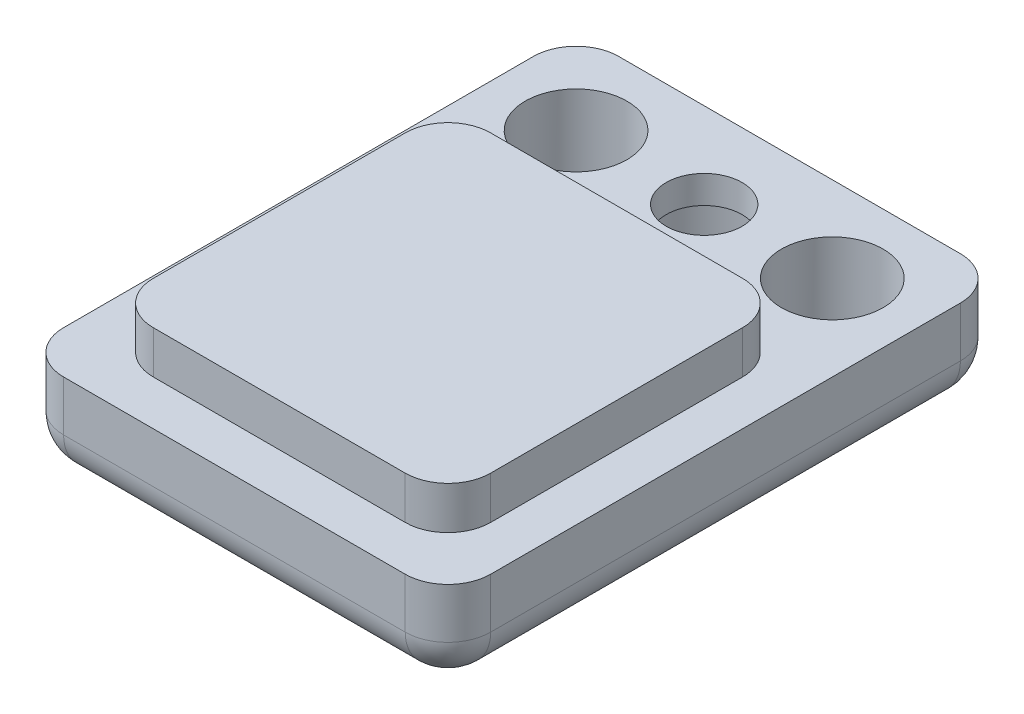
ISO-10303-21;
HEADER;
FILE_DESCRIPTION(('STEP AP214'),'2;1');
FILE_NAME('part.step','',(''),(''),'','','');
FILE_SCHEMA(('AUTOMOTIVE_DESIGN { 1 0 10303 214 1 1 1 1 }'));
ENDSEC;
DATA;
#1=APPLICATION_CONTEXT('core data for automotive mechanical design processes');
#2=APPLICATION_PROTOCOL_DEFINITION('international standard','automotive_design',2000,#1);
#3=PRODUCT_CONTEXT('',#1,'mechanical');
#4=PRODUCT('Part','Part','',(#3));
#5=PRODUCT_RELATED_PRODUCT_CATEGORY('part','',(#4));
#6=PRODUCT_DEFINITION_FORMATION('','',#4);
#7=PRODUCT_DEFINITION_CONTEXT('part definition',#1,'design');
#8=PRODUCT_DEFINITION('design','',#6,#7);
#9=PRODUCT_DEFINITION_SHAPE('','',#8);
#10=(LENGTH_UNIT() NAMED_UNIT(*) SI_UNIT(.MILLI.,.METRE.));
#11=(NAMED_UNIT(*) PLANE_ANGLE_UNIT() SI_UNIT($,.RADIAN.));
#12=(NAMED_UNIT(*) SI_UNIT($,.STERADIAN.) SOLID_ANGLE_UNIT());
#13=UNCERTAINTY_MEASURE_WITH_UNIT(LENGTH_MEASURE(1.E-05),#10,'distance_accuracy_value','');
#14=(GEOMETRIC_REPRESENTATION_CONTEXT(3) GLOBAL_UNCERTAINTY_ASSIGNED_CONTEXT((#13)) GLOBAL_UNIT_ASSIGNED_CONTEXT((#10,
#11,#12)) REPRESENTATION_CONTEXT('',''));
#15=CARTESIAN_POINT('',(0.,0.,0.));
#16=DIRECTION('',(0.,0.,1.));
#17=DIRECTION('',(1.,0.,0.));
#18=AXIS2_PLACEMENT_3D('',#15,#16,#17);
#19=CARTESIAN_POINT('',(-5.,0.,-6.5));
#20=DIRECTION('',(0.,1.,0.));
#21=DIRECTION('',(0.,0.,1.));
#22=AXIS2_PLACEMENT_3D('',#19,#20,#21);
#23=PLANE('',#22);
#24=CARTESIAN_POINT('',(-3.,0.,-4.5));
#25=DIRECTION('',(0.,-1.,0.));
#26=DIRECTION('',(0.,0.,-1.));
#27=AXIS2_PLACEMENT_3D('',#24,#25,#26);
#28=CIRCLE('',#27,1.190625);
#29=CARTESIAN_POINT('',(-2.35378959260548,0.,-5.5));
#30=VERTEX_POINT('',#29);
#31=CARTESIAN_POINT('',(-4.,0.,-3.85378959260548));
#32=VERTEX_POINT('',#31);
#33=EDGE_CURVE('E312',#30,#32,#28,.T.);
#34=ORIENTED_EDGE('',*,*,#33,.F.);
#35=DIRECTION('',(-1.,0.,0.));
#36=VECTOR('',#35,1.);
#37=CARTESIAN_POINT('',(-5.,0.,-5.5));
#38=LINE('',#37,#36);
#39=CARTESIAN_POINT('',(-1.23294616670802,0.,-5.5));
#40=VERTEX_POINT('',#39);
#41=EDGE_CURVE('E239',#30,#40,#38,.F.);
#42=ORIENTED_EDGE('',*,*,#41,.T.);
#43=CARTESIAN_POINT('',(0.,0.,-4.5));
#44=DIRECTION('',(0.,-1.,0.));
#45=DIRECTION('',(0.,0.,-1.));
#46=AXIS2_PLACEMENT_3D('',#43,#44,#45);
#47=CIRCLE('',#46,1.5875);
#48=CARTESIAN_POINT('',(1.23294616670802,0.,-5.5));
#49=VERTEX_POINT('',#48);
#50=EDGE_CURVE('E329',#49,#40,#47,.T.);
#51=ORIENTED_EDGE('',*,*,#50,.F.);
#52=DIRECTION('',(-1.,0.,0.));
#53=VECTOR('',#52,1.);
#54=CARTESIAN_POINT('',(-5.,0.,-5.5));
#55=LINE('',#54,#53);
#56=CARTESIAN_POINT('',(2.35378959260548,0.,-5.5));
#57=VERTEX_POINT('',#56);
#58=EDGE_CURVE('E237',#49,#57,#55,.F.);
#59=ORIENTED_EDGE('',*,*,#58,.T.);
#60=CARTESIAN_POINT('',(3.,0.,-4.5));
#61=DIRECTION('',(0.,-1.,0.));
#62=DIRECTION('',(0.,0.,-1.));
#63=AXIS2_PLACEMENT_3D('',#60,#61,#62);
#64=CIRCLE('',#63,1.190625);
#65=CARTESIAN_POINT('',(4.,0.,-3.85378959260548));
#66=VERTEX_POINT('',#65);
#67=EDGE_CURVE('E327',#66,#57,#64,.T.);
#68=ORIENTED_EDGE('',*,*,#67,.F.);
#69=DIRECTION('',(0.,0.,-1.));
#70=VECTOR('',#69,1.);
#71=CARTESIAN_POINT('',(4.,0.,-6.5));
#72=LINE('',#71,#70);
#73=CARTESIAN_POINT('',(4.,0.,5.5));
#74=VERTEX_POINT('',#73);
#75=EDGE_CURVE('E226',#66,#74,#72,.F.);
#76=ORIENTED_EDGE('',*,*,#75,.T.);
#77=DIRECTION('',(1.,0.,0.));
#78=VECTOR('',#77,1.);
#79=CARTESIAN_POINT('',(-5.,0.,5.5));
#80=LINE('',#79,#78);
#81=CARTESIAN_POINT('',(-4.,0.,5.5));
#82=VERTEX_POINT('',#81);
#83=EDGE_CURVE('E217',#74,#82,#80,.F.);
#84=ORIENTED_EDGE('',*,*,#83,.T.);
#85=DIRECTION('',(0.,0.,1.));
#86=VECTOR('',#85,1.);
#87=CARTESIAN_POINT('',(-4.,0.,-6.5));
#88=LINE('',#87,#86);
#89=EDGE_CURVE('E220',#82,#32,#88,.F.);
#90=ORIENTED_EDGE('',*,*,#89,.T.);
#91=EDGE_LOOP('',(#34,#42,#51,#59,#68,#76,#84,#90));
#92=FACE_BOUND('',#91,.T.);
#93=ADVANCED_FACE('F31',(#92),#23,.F.);
#94=CARTESIAN_POINT('',(3.64621040739452,0.,-5.5));
#95=VERTEX_POINT('',#94);
#96=CARTESIAN_POINT('',(4.,0.,-5.14621040739452));
#97=VERTEX_POINT('',#96);
#98=EDGE_CURVE('E334',#95,#97,#64,.T.);
#99=ORIENTED_EDGE('',*,*,#98,.F.);
#100=DIRECTION('',(-1.,0.,0.));
#101=VECTOR('',#100,1.);
#102=CARTESIAN_POINT('',(-5.,0.,-5.5));
#103=LINE('',#102,#101);
#104=CARTESIAN_POINT('',(4.,0.,-5.5));
#105=VERTEX_POINT('',#104);
#106=EDGE_CURVE('E235',#95,#105,#103,.F.);
#107=ORIENTED_EDGE('',*,*,#106,.T.);
#108=DIRECTION('',(0.,0.,-1.));
#109=VECTOR('',#108,1.);
#110=CARTESIAN_POINT('',(4.,0.,-6.5));
#111=LINE('',#110,#109);
#112=EDGE_CURVE('E233',#105,#97,#111,.F.);
#113=ORIENTED_EDGE('',*,*,#112,.T.);
#114=EDGE_LOOP('',(#99,#107,#113));
#115=FACE_BOUND('',#114,.T.);
#116=ADVANCED_FACE('F384',(#115),#23,.F.);
#117=CARTESIAN_POINT('',(-5.,2.175,-6.5));
#118=DIRECTION('',(0.,1.,0.));
#119=DIRECTION('',(0.,0.,1.));
#120=AXIS2_PLACEMENT_3D('',#117,#118,#119);
#121=PLANE('',#120);
#122=CARTESIAN_POINT('',(-3.,2.175,-4.5));
#123=DIRECTION('',(0.,1.,0.));
#124=DIRECTION('',(0.,0.,1.));
#125=AXIS2_PLACEMENT_3D('',#122,#123,#124);
#126=CIRCLE('',#125,1.190625);
#127=CARTESIAN_POINT('',(-3.,2.175,-3.309375));
#128=VERTEX_POINT('',#127);
#129=EDGE_CURVE('E320',#128,#128,#126,.T.);
#130=ORIENTED_EDGE('',*,*,#129,.F.);
#131=EDGE_LOOP('',(#130));
#132=FACE_BOUND('',#131,.T.);
#133=CARTESIAN_POINT('',(3.,2.175,-4.5));
#134=DIRECTION('',(0.,1.,0.));
#135=DIRECTION('',(0.,0.,1.));
#136=AXIS2_PLACEMENT_3D('',#133,#134,#135);
#137=CIRCLE('',#136,1.190625);
#138=CARTESIAN_POINT('',(3.,2.175,-3.309375));
#139=VERTEX_POINT('',#138);
#140=EDGE_CURVE('E336',#139,#139,#137,.T.);
#141=ORIENTED_EDGE('',*,*,#140,.F.);
#142=EDGE_LOOP('',(#141));
#143=FACE_BOUND('',#142,.T.);
#144=CARTESIAN_POINT('',(0.,2.175,-4.5));
#145=DIRECTION('',(0.,1.,0.));
#146=DIRECTION('',(0.,0.,1.));
#147=AXIS2_PLACEMENT_3D('',#144,#145,#146);
#148=CIRCLE('',#147,0.888999999999999);
#149=CARTESIAN_POINT('',(0.,2.175,-3.611));
#150=VERTEX_POINT('',#149);
#151=EDGE_CURVE('E349',#150,#150,#148,.T.);
#152=ORIENTED_EDGE('',*,*,#151,.F.);
#153=EDGE_LOOP('',(#152));
#154=FACE_BOUND('',#153,.T.);
#155=DIRECTION('',(1.,0.,0.));
#156=VECTOR('',#155,1.);
#157=CARTESIAN_POINT('',(5.,2.175,6.5));
#158=LINE('',#157,#156);
#159=CARTESIAN_POINT('',(-4.,2.175,6.5));
#160=VERTEX_POINT('',#159);
#161=CARTESIAN_POINT('',(4.,2.175,6.5));
#162=VERTEX_POINT('',#161);
#163=EDGE_CURVE('E374',#160,#162,#158,.T.);
#164=ORIENTED_EDGE('',*,*,#163,.T.);
#165=CARTESIAN_POINT('',(4.,2.175,5.5));
#166=DIRECTION('',(0.,1.,0.));
#167=DIRECTION('',(0.,0.,1.));
#168=AXIS2_PLACEMENT_3D('',#165,#166,#167);
#169=CIRCLE('',#168,1.);
#170=CARTESIAN_POINT('',(5.,2.175,5.5));
#171=VERTEX_POINT('',#170);
#172=EDGE_CURVE('E202',#162,#171,#169,.T.);
#173=ORIENTED_EDGE('',*,*,#172,.T.);
#174=DIRECTION('',(0.,0.,-1.));
#175=VECTOR('',#174,1.);
#176=CARTESIAN_POINT('',(5.,2.175,6.5));
#177=LINE('',#176,#175);
#178=CARTESIAN_POINT('',(5.,2.175,-5.5));
#179=VERTEX_POINT('',#178);
#180=EDGE_CURVE('E198',#171,#179,#177,.T.);
#181=ORIENTED_EDGE('',*,*,#180,.T.);
#182=CARTESIAN_POINT('',(4.,2.175,-5.5));
#183=DIRECTION('',(0.,1.,0.));
#184=DIRECTION('',(0.,0.,1.));
#185=AXIS2_PLACEMENT_3D('',#182,#183,#184);
#186=CIRCLE('',#185,1.);
#187=CARTESIAN_POINT('',(4.,2.175,-6.5));
#188=VERTEX_POINT('',#187);
#189=EDGE_CURVE('E190',#179,#188,#186,.T.);
#190=ORIENTED_EDGE('',*,*,#189,.T.);
#191=DIRECTION('',(-1.,0.,0.));
#192=VECTOR('',#191,1.);
#193=CARTESIAN_POINT('',(5.,2.175,-6.5));
#194=LINE('',#193,#192);
#195=CARTESIAN_POINT('',(-4.,2.175,-6.5));
#196=VERTEX_POINT('',#195);
#197=EDGE_CURVE('E195',#188,#196,#194,.T.);
#198=ORIENTED_EDGE('',*,*,#197,.T.);
#199=CARTESIAN_POINT('',(-4.,2.175,-5.5));
#200=DIRECTION('',(0.,1.,0.));
#201=DIRECTION('',(0.,0.,1.));
#202=AXIS2_PLACEMENT_3D('',#199,#200,#201);
#203=CIRCLE('',#202,1.);
#204=CARTESIAN_POINT('',(-5.,2.175,-5.5));
#205=VERTEX_POINT('',#204);
#206=EDGE_CURVE('E203',#196,#205,#203,.T.);
#207=ORIENTED_EDGE('',*,*,#206,.T.);
#208=DIRECTION('',(0.,0.,1.));
#209=VECTOR('',#208,1.);
#210=CARTESIAN_POINT('',(-5.,2.175,6.5));
#211=LINE('',#210,#209);
#212=CARTESIAN_POINT('',(-5.,2.175,5.5));
#213=VERTEX_POINT('',#212);
#214=EDGE_CURVE('E361',#205,#213,#211,.T.);
#215=ORIENTED_EDGE('',*,*,#214,.T.);
#216=CARTESIAN_POINT('',(-4.,2.175,5.5));
#217=DIRECTION('',(0.,1.,0.));
#218=DIRECTION('',(0.,0.,1.));
#219=AXIS2_PLACEMENT_3D('',#216,#217,#218);
#220=CIRCLE('',#219,1.);
#221=EDGE_CURVE('E482',#213,#160,#220,.T.);
#222=ORIENTED_EDGE('',*,*,#221,.T.);
#223=EDGE_LOOP('',(#164,#173,#181,#190,#198,#207,#215,#222));
#224=FACE_BOUND('',#223,.T.);
#225=DIRECTION('',(1.,0.,0.));
#226=VECTOR('',#225,1.);
#227=CARTESIAN_POINT('',(-3.95,2.175,5.45));
#228=LINE('',#227,#226);
#229=CARTESIAN_POINT('',(-2.95,2.175,5.45));
#230=VERTEX_POINT('',#229);
#231=CARTESIAN_POINT('',(2.95,2.175,5.45));
#232=VERTEX_POINT('',#231);
#233=EDGE_CURVE('E365',#230,#232,#228,.T.);
#234=ORIENTED_EDGE('',*,*,#233,.F.);
#235=CARTESIAN_POINT('',(-2.95,2.175,4.45));
#236=DIRECTION('',(0.,1.,0.));
#237=DIRECTION('',(0.,0.,1.));
#238=AXIS2_PLACEMENT_3D('',#235,#236,#237);
#239=CIRCLE('',#238,1.);
#240=CARTESIAN_POINT('',(-3.95,2.175,4.45));
#241=VERTEX_POINT('',#240);
#242=EDGE_CURVE('E11',#230,#241,#239,.F.);
#243=ORIENTED_EDGE('',*,*,#242,.T.);
#244=DIRECTION('',(0.,0.,1.));
#245=VECTOR('',#244,1.);
#246=CARTESIAN_POINT('',(-3.95,2.175,5.45));
#247=LINE('',#246,#245);
#248=CARTESIAN_POINT('',(-3.95,2.175,-1.45));
#249=VERTEX_POINT('',#248);
#250=EDGE_CURVE('E362',#249,#241,#247,.T.);
#251=ORIENTED_EDGE('',*,*,#250,.F.);
#252=CARTESIAN_POINT('',(-2.95,2.175,-1.45));
#253=DIRECTION('',(0.,1.,0.));
#254=DIRECTION('',(0.,0.,1.));
#255=AXIS2_PLACEMENT_3D('',#252,#253,#254);
#256=CIRCLE('',#255,1.);
#257=CARTESIAN_POINT('',(-2.95,2.175,-2.45));
#258=VERTEX_POINT('',#257);
#259=EDGE_CURVE('E40',#249,#258,#256,.F.);
#260=ORIENTED_EDGE('',*,*,#259,.T.);
#261=DIRECTION('',(-1.,0.,0.));
#262=VECTOR('',#261,1.);
#263=CARTESIAN_POINT('',(-3.95,2.175,-2.45));
#264=LINE('',#263,#262);
#265=CARTESIAN_POINT('',(2.95,2.175,-2.45));
#266=VERTEX_POINT('',#265);
#267=EDGE_CURVE('E354',#266,#258,#264,.T.);
#268=ORIENTED_EDGE('',*,*,#267,.F.);
#269=CARTESIAN_POINT('',(2.95,2.175,-1.45));
#270=DIRECTION('',(0.,1.,0.));
#271=DIRECTION('',(0.,0.,1.));
#272=AXIS2_PLACEMENT_3D('',#269,#270,#271);
#273=CIRCLE('',#272,1.);
#274=CARTESIAN_POINT('',(3.95,2.175,-1.45));
#275=VERTEX_POINT('',#274);
#276=EDGE_CURVE('E514',#266,#275,#273,.F.);
#277=ORIENTED_EDGE('',*,*,#276,.T.);
#278=DIRECTION('',(0.,0.,-1.));
#279=VECTOR('',#278,1.);
#280=CARTESIAN_POINT('',(3.95,2.175,5.45));
#281=LINE('',#280,#279);
#282=CARTESIAN_POINT('',(3.95,2.175,4.45));
#283=VERTEX_POINT('',#282);
#284=EDGE_CURVE('E368',#283,#275,#281,.T.);
#285=ORIENTED_EDGE('',*,*,#284,.F.);
#286=CARTESIAN_POINT('',(2.95,2.175,4.45));
#287=DIRECTION('',(0.,1.,0.));
#288=DIRECTION('',(0.,0.,1.));
#289=AXIS2_PLACEMENT_3D('',#286,#287,#288);
#290=CIRCLE('',#289,1.);
#291=EDGE_CURVE('E512',#283,#232,#290,.F.);
#292=ORIENTED_EDGE('',*,*,#291,.T.);
#293=EDGE_LOOP('',(#234,#243,#251,#260,#268,#277,#285,#292));
#294=FACE_BOUND('',#293,.T.);
#295=ADVANCED_FACE('F193',(#132,#143,#154,#224,#294),#121,.T.);
#296=CARTESIAN_POINT('',(-5.,2.175,6.5));
#297=DIRECTION('',(1.,0.,0.));
#298=DIRECTION('',(0.,0.,-1.));
#299=AXIS2_PLACEMENT_3D('',#296,#297,#298);
#300=PLANE('',#299);
#301=ORIENTED_EDGE('',*,*,#214,.F.);
#302=DIRECTION('',(0.,-1.,0.));
#303=VECTOR('',#302,1.);
#304=CARTESIAN_POINT('',(-5.,2.175,-5.5));
#305=LINE('',#304,#303);
#306=CARTESIAN_POINT('',(-5.,1.,-5.5));
#307=VERTEX_POINT('',#306);
#308=EDGE_CURVE('E474',#205,#307,#305,.T.);
#309=ORIENTED_EDGE('',*,*,#308,.T.);
#310=DIRECTION('',(0.,0.,1.));
#311=VECTOR('',#310,1.);
#312=CARTESIAN_POINT('',(-5.,1.,6.5));
#313=LINE('',#312,#311);
#314=CARTESIAN_POINT('',(-5.,1.,5.5));
#315=VERTEX_POINT('',#314);
#316=EDGE_CURVE('E420',#307,#315,#313,.T.);
#317=ORIENTED_EDGE('',*,*,#316,.T.);
#318=DIRECTION('',(0.,-1.,0.));
#319=VECTOR('',#318,1.);
#320=CARTESIAN_POINT('',(-5.,2.175,5.5));
#321=LINE('',#320,#319);
#322=EDGE_CURVE('E469',#315,#213,#321,.F.);
#323=ORIENTED_EDGE('',*,*,#322,.T.);
#324=EDGE_LOOP('',(#301,#309,#317,#323));
#325=FACE_BOUND('',#324,.T.);
#326=ADVANCED_FACE('F296',(#325),#300,.F.);
#327=CARTESIAN_POINT('',(5.,2.175,6.5));
#328=DIRECTION('',(0.,0.,-1.));
#329=DIRECTION('',(-1.,0.,0.));
#330=AXIS2_PLACEMENT_3D('',#327,#328,#329);
#331=PLANE('',#330);
#332=DIRECTION('',(1.,0.,0.));
#333=VECTOR('',#332,1.);
#334=CARTESIAN_POINT('',(5.,1.,6.5));
#335=LINE('',#334,#333);
#336=CARTESIAN_POINT('',(-4.,1.,6.5));
#337=VERTEX_POINT('',#336);
#338=CARTESIAN_POINT('',(4.,1.,6.5));
#339=VERTEX_POINT('',#338);
#340=EDGE_CURVE('E478',#337,#339,#335,.T.);
#341=ORIENTED_EDGE('',*,*,#340,.T.);
#342=DIRECTION('',(0.,-1.,0.));
#343=VECTOR('',#342,1.);
#344=CARTESIAN_POINT('',(4.,2.175,6.5));
#345=LINE('',#344,#343);
#346=EDGE_CURVE('E480',#339,#162,#345,.F.);
#347=ORIENTED_EDGE('',*,*,#346,.T.);
#348=ORIENTED_EDGE('',*,*,#163,.F.);
#349=DIRECTION('',(0.,-1.,0.));
#350=VECTOR('',#349,1.);
#351=CARTESIAN_POINT('',(-4.,2.175,6.5));
#352=LINE('',#351,#350);
#353=EDGE_CURVE('E476',#160,#337,#352,.T.);
#354=ORIENTED_EDGE('',*,*,#353,.T.);
#355=EDGE_LOOP('',(#341,#347,#348,#354));
#356=FACE_BOUND('',#355,.T.);
#357=ADVANCED_FACE('F391',(#356),#331,.F.);
#358=CARTESIAN_POINT('',(5.,2.175,6.5));
#359=DIRECTION('',(-1.,0.,0.));
#360=DIRECTION('',(0.,0.,1.));
#361=AXIS2_PLACEMENT_3D('',#358,#359,#360);
#362=PLANE('',#361);
#363=ORIENTED_EDGE('',*,*,#180,.F.);
#364=DIRECTION('',(0.,-1.,0.));
#365=VECTOR('',#364,1.);
#366=CARTESIAN_POINT('',(5.,2.175,5.5));
#367=LINE('',#366,#365);
#368=CARTESIAN_POINT('',(5.,1.,5.5));
#369=VERTEX_POINT('',#368);
#370=EDGE_CURVE('E468',#171,#369,#367,.T.);
#371=ORIENTED_EDGE('',*,*,#370,.T.);
#372=DIRECTION('',(0.,0.,-1.));
#373=VECTOR('',#372,1.);
#374=CARTESIAN_POINT('',(5.,1.,6.5));
#375=LINE('',#374,#373);
#376=CARTESIAN_POINT('',(5.,1.,-5.5));
#377=VERTEX_POINT('',#376);
#378=EDGE_CURVE('E465',#369,#377,#375,.T.);
#379=ORIENTED_EDGE('',*,*,#378,.T.);
#380=DIRECTION('',(0.,-1.,0.));
#381=VECTOR('',#380,1.);
#382=CARTESIAN_POINT('',(5.,2.175,-5.5));
#383=LINE('',#382,#381);
#384=EDGE_CURVE('E286',#377,#179,#383,.F.);
#385=ORIENTED_EDGE('',*,*,#384,.T.);
#386=EDGE_LOOP('',(#363,#371,#379,#385));
#387=FACE_BOUND('',#386,.T.);
#388=ADVANCED_FACE('F412',(#387),#362,.F.);
#389=CARTESIAN_POINT('',(5.,2.175,-6.5));
#390=DIRECTION('',(0.,0.,1.));
#391=DIRECTION('',(1.,0.,0.));
#392=AXIS2_PLACEMENT_3D('',#389,#390,#391);
#393=PLANE('',#392);
#394=ORIENTED_EDGE('',*,*,#197,.F.);
#395=DIRECTION('',(0.,-1.,0.));
#396=VECTOR('',#395,1.);
#397=CARTESIAN_POINT('',(4.,2.175,-6.5));
#398=LINE('',#397,#396);
#399=CARTESIAN_POINT('',(4.,1.,-6.5));
#400=VERTEX_POINT('',#399);
#401=EDGE_CURVE('E208',#188,#400,#398,.T.);
#402=ORIENTED_EDGE('',*,*,#401,.T.);
#403=DIRECTION('',(-1.,0.,0.));
#404=VECTOR('',#403,1.);
#405=CARTESIAN_POINT('',(5.,1.,-6.5));
#406=LINE('',#405,#404);
#407=CARTESIAN_POINT('',(-4.,1.,-6.5));
#408=VERTEX_POINT('',#407);
#409=EDGE_CURVE('E218',#400,#408,#406,.T.);
#410=ORIENTED_EDGE('',*,*,#409,.T.);
#411=DIRECTION('',(0.,-1.,0.));
#412=VECTOR('',#411,1.);
#413=CARTESIAN_POINT('',(-4.,2.175,-6.5));
#414=LINE('',#413,#412);
#415=EDGE_CURVE('E211',#408,#196,#414,.F.);
#416=ORIENTED_EDGE('',*,*,#415,.T.);
#417=EDGE_LOOP('',(#394,#402,#410,#416));
#418=FACE_BOUND('',#417,.T.);
#419=ADVANCED_FACE('F206',(#418),#393,.F.);
#420=DIRECTION('',(0.,0.,1.));
#421=VECTOR('',#420,1.);
#422=CARTESIAN_POINT('',(-4.,0.,-6.5));
#423=LINE('',#422,#421);
#424=CARTESIAN_POINT('',(-4.,0.,-5.14621040739452));
#425=VERTEX_POINT('',#424);
#426=CARTESIAN_POINT('',(-4.,0.,-5.5));
#427=VERTEX_POINT('',#426);
#428=EDGE_CURVE('E228',#425,#427,#423,.F.);
#429=ORIENTED_EDGE('',*,*,#428,.T.);
#430=DIRECTION('',(-1.,0.,0.));
#431=VECTOR('',#430,1.);
#432=CARTESIAN_POINT('',(-5.,0.,-5.5));
#433=LINE('',#432,#431);
#434=CARTESIAN_POINT('',(-3.64621040739452,0.,-5.5));
#435=VERTEX_POINT('',#434);
#436=EDGE_CURVE('E230',#427,#435,#433,.F.);
#437=ORIENTED_EDGE('',*,*,#436,.T.);
#438=EDGE_CURVE('E315',#425,#435,#28,.T.);
#439=ORIENTED_EDGE('',*,*,#438,.F.);
#440=EDGE_LOOP('',(#429,#437,#439));
#441=FACE_BOUND('',#440,.T.);
#442=ADVANCED_FACE('F395',(#441),#23,.F.);
#443=CARTESIAN_POINT('',(-3.95,3.175,5.45));
#444=DIRECTION('',(1.,0.,0.));
#445=DIRECTION('',(0.,0.,-1.));
#446=AXIS2_PLACEMENT_3D('',#443,#444,#445);
#447=PLANE('',#446);
#448=DIRECTION('',(0.,0.,1.));
#449=VECTOR('',#448,1.);
#450=CARTESIAN_POINT('',(-3.95,3.175,5.45));
#451=LINE('',#450,#449);
#452=CARTESIAN_POINT('',(-3.95,3.175,-1.45));
#453=VERTEX_POINT('',#452);
#454=CARTESIAN_POINT('',(-3.95,3.175,4.45));
#455=VERTEX_POINT('',#454);
#456=EDGE_CURVE('E350',#453,#455,#451,.T.);
#457=ORIENTED_EDGE('',*,*,#456,.F.);
#458=DIRECTION('',(0.,-1.,0.));
#459=VECTOR('',#458,1.);
#460=CARTESIAN_POINT('',(-3.95,3.175,-1.45));
#461=LINE('',#460,#459);
#462=EDGE_CURVE('E509',#453,#249,#461,.T.);
#463=ORIENTED_EDGE('',*,*,#462,.T.);
#464=ORIENTED_EDGE('',*,*,#250,.T.);
#465=DIRECTION('',(0.,-1.,0.));
#466=VECTOR('',#465,1.);
#467=CARTESIAN_POINT('',(-3.95,3.175,4.45));
#468=LINE('',#467,#466);
#469=EDGE_CURVE('E507',#241,#455,#468,.F.);
#470=ORIENTED_EDGE('',*,*,#469,.T.);
#471=EDGE_LOOP('',(#457,#463,#464,#470));
#472=FACE_BOUND('',#471,.T.);
#473=ADVANCED_FACE('F404',(#472),#447,.F.);
#474=CARTESIAN_POINT('',(-3.95,3.175,5.45));
#475=DIRECTION('',(0.,0.,-1.));
#476=DIRECTION('',(-1.,0.,0.));
#477=AXIS2_PLACEMENT_3D('',#474,#475,#476);
#478=PLANE('',#477);
#479=ORIENTED_EDGE('',*,*,#233,.T.);
#480=DIRECTION('',(0.,-1.,0.));
#481=VECTOR('',#480,1.);
#482=CARTESIAN_POINT('',(2.95,3.175,5.45));
#483=LINE('',#482,#481);
#484=CARTESIAN_POINT('',(2.95,3.175,5.45));
#485=VERTEX_POINT('',#484);
#486=EDGE_CURVE('E494',#232,#485,#483,.F.);
#487=ORIENTED_EDGE('',*,*,#486,.T.);
#488=DIRECTION('',(1.,0.,0.));
#489=VECTOR('',#488,1.);
#490=CARTESIAN_POINT('',(-3.95,3.175,5.45));
#491=LINE('',#490,#489);
#492=CARTESIAN_POINT('',(-2.95,3.175,5.45));
#493=VERTEX_POINT('',#492);
#494=EDGE_CURVE('E353',#493,#485,#491,.T.);
#495=ORIENTED_EDGE('',*,*,#494,.F.);
#496=DIRECTION('',(0.,-1.,0.));
#497=VECTOR('',#496,1.);
#498=CARTESIAN_POINT('',(-2.95,3.175,5.45));
#499=LINE('',#498,#497);
#500=EDGE_CURVE('E491',#493,#230,#499,.T.);
#501=ORIENTED_EDGE('',*,*,#500,.T.);
#502=EDGE_LOOP('',(#479,#487,#495,#501));
#503=FACE_BOUND('',#502,.T.);
#504=ADVANCED_FACE('F410',(#503),#478,.F.);
#505=CARTESIAN_POINT('',(3.95,3.175,5.45));
#506=DIRECTION('',(-1.,0.,0.));
#507=DIRECTION('',(0.,0.,1.));
#508=AXIS2_PLACEMENT_3D('',#505,#506,#507);
#509=PLANE('',#508);
#510=DIRECTION('',(0.,0.,-1.));
#511=VECTOR('',#510,1.);
#512=CARTESIAN_POINT('',(3.95,3.175,5.45));
#513=LINE('',#512,#511);
#514=CARTESIAN_POINT('',(3.95,3.175,4.45));
#515=VERTEX_POINT('',#514);
#516=CARTESIAN_POINT('',(3.95,3.175,-1.45));
#517=VERTEX_POINT('',#516);
#518=EDGE_CURVE('E357',#515,#517,#513,.T.);
#519=ORIENTED_EDGE('',*,*,#518,.F.);
#520=DIRECTION('',(0.,-1.,0.));
#521=VECTOR('',#520,1.);
#522=CARTESIAN_POINT('',(3.95,3.175,4.45));
#523=LINE('',#522,#521);
#524=EDGE_CURVE('E488',#515,#283,#523,.T.);
#525=ORIENTED_EDGE('',*,*,#524,.T.);
#526=ORIENTED_EDGE('',*,*,#284,.T.);
#527=DIRECTION('',(0.,-1.,0.));
#528=VECTOR('',#527,1.);
#529=CARTESIAN_POINT('',(3.95,3.175,-1.45));
#530=LINE('',#529,#528);
#531=EDGE_CURVE('E486',#275,#517,#530,.F.);
#532=ORIENTED_EDGE('',*,*,#531,.T.);
#533=EDGE_LOOP('',(#519,#525,#526,#532));
#534=FACE_BOUND('',#533,.T.);
#535=ADVANCED_FACE('F538',(#534),#509,.F.);
#536=CARTESIAN_POINT('',(-3.95,3.175,-2.45));
#537=DIRECTION('',(0.,0.,1.));
#538=DIRECTION('',(1.,0.,0.));
#539=AXIS2_PLACEMENT_3D('',#536,#537,#538);
#540=PLANE('',#539);
#541=DIRECTION('',(-1.,0.,0.));
#542=VECTOR('',#541,1.);
#543=CARTESIAN_POINT('',(-3.95,3.175,-2.45));
#544=LINE('',#543,#542);
#545=CARTESIAN_POINT('',(2.95,3.175,-2.45));
#546=VERTEX_POINT('',#545);
#547=CARTESIAN_POINT('',(-2.95,3.175,-2.45));
#548=VERTEX_POINT('',#547);
#549=EDGE_CURVE('E359',#546,#548,#544,.T.);
#550=ORIENTED_EDGE('',*,*,#549,.F.);
#551=DIRECTION('',(0.,-1.,0.));
#552=VECTOR('',#551,1.);
#553=CARTESIAN_POINT('',(2.95,3.175,-2.45));
#554=LINE('',#553,#552);
#555=EDGE_CURVE('E504',#546,#266,#554,.T.);
#556=ORIENTED_EDGE('',*,*,#555,.T.);
#557=ORIENTED_EDGE('',*,*,#267,.T.);
#558=DIRECTION('',(0.,-1.,0.));
#559=VECTOR('',#558,1.);
#560=CARTESIAN_POINT('',(-2.95,3.175,-2.45));
#561=LINE('',#560,#559);
#562=EDGE_CURVE('E48',#258,#548,#561,.F.);
#563=ORIENTED_EDGE('',*,*,#562,.T.);
#564=EDGE_LOOP('',(#550,#556,#557,#563));
#565=FACE_BOUND('',#564,.T.);
#566=ADVANCED_FACE('F520',(#565),#540,.F.);
#567=CARTESIAN_POINT('',(-3.95,3.175,-2.45));
#568=DIRECTION('',(0.,-1.,0.));
#569=DIRECTION('',(0.,0.,-1.));
#570=AXIS2_PLACEMENT_3D('',#567,#568,#569);
#571=PLANE('',#570);
#572=ORIENTED_EDGE('',*,*,#494,.T.);
#573=CARTESIAN_POINT('',(2.95,3.175,4.45));
#574=DIRECTION('',(0.,-1.,0.));
#575=DIRECTION('',(0.,0.,-1.));
#576=AXIS2_PLACEMENT_3D('',#573,#574,#575);
#577=CIRCLE('',#576,1.);
#578=EDGE_CURVE('E501',#485,#515,#577,.F.);
#579=ORIENTED_EDGE('',*,*,#578,.T.);
#580=ORIENTED_EDGE('',*,*,#518,.T.);
#581=CARTESIAN_POINT('',(2.95,3.175,-1.45));
#582=DIRECTION('',(0.,-1.,0.));
#583=DIRECTION('',(0.,0.,-1.));
#584=AXIS2_PLACEMENT_3D('',#581,#582,#583);
#585=CIRCLE('',#584,1.);
#586=EDGE_CURVE('E55',#517,#546,#585,.F.);
#587=ORIENTED_EDGE('',*,*,#586,.T.);
#588=ORIENTED_EDGE('',*,*,#549,.T.);
#589=CARTESIAN_POINT('',(-2.95,3.175,-1.45));
#590=DIRECTION('',(0.,-1.,0.));
#591=DIRECTION('',(0.,0.,-1.));
#592=AXIS2_PLACEMENT_3D('',#589,#590,#591);
#593=CIRCLE('',#592,1.);
#594=EDGE_CURVE('E498',#548,#453,#593,.F.);
#595=ORIENTED_EDGE('',*,*,#594,.T.);
#596=ORIENTED_EDGE('',*,*,#456,.T.);
#597=CARTESIAN_POINT('',(-2.95,3.175,4.45));
#598=DIRECTION('',(0.,-1.,0.));
#599=DIRECTION('',(0.,0.,-1.));
#600=AXIS2_PLACEMENT_3D('',#597,#598,#599);
#601=CIRCLE('',#600,1.);
#602=EDGE_CURVE('E496',#455,#493,#601,.F.);
#603=ORIENTED_EDGE('',*,*,#602,.T.);
#604=EDGE_LOOP('',(#572,#579,#580,#587,#588,#595,#596,#603));
#605=FACE_BOUND('',#604,.T.);
#606=ADVANCED_FACE('F525',(#605),#571,.F.);
#607=CARTESIAN_POINT('',(0.,0.,-4.5));
#608=DIRECTION('',(0.,-1.,0.));
#609=DIRECTION('',(0.,0.,-1.));
#610=AXIS2_PLACEMENT_3D('',#607,#608,#609);
#611=CYLINDRICAL_SURFACE('',#610,0.888999999999999);
#612=ORIENTED_EDGE('',*,*,#151,.T.);
#613=EDGE_LOOP('',(#612));
#614=FACE_BOUND('',#613,.T.);
#615=CARTESIAN_POINT('',(0.,1.524,-4.5));
#616=DIRECTION('',(0.,-1.,0.));
#617=DIRECTION('',(0.,0.,-1.));
#618=AXIS2_PLACEMENT_3D('',#615,#616,#617);
#619=CIRCLE('',#618,0.889);
#620=CARTESIAN_POINT('',(0.,1.524,-5.389));
#621=VERTEX_POINT('',#620);
#622=EDGE_CURVE('E346',#621,#621,#619,.T.);
#623=ORIENTED_EDGE('',*,*,#622,.T.);
#624=EDGE_LOOP('',(#623));
#625=FACE_BOUND('',#624,.T.);
#626=ADVANCED_FACE('F380',(#614,#625),#611,.F.);
#627=CARTESIAN_POINT('',(0.889,1.524,-4.5));
#628=DIRECTION('',(0.,1.,0.));
#629=DIRECTION('',(0.,0.,1.));
#630=AXIS2_PLACEMENT_3D('',#627,#628,#629);
#631=PLANE('',#630);
#632=ORIENTED_EDGE('',*,*,#622,.F.);
#633=EDGE_LOOP('',(#632));
#634=FACE_BOUND('',#633,.T.);
#635=CARTESIAN_POINT('',(0.,1.524,-4.5));
#636=DIRECTION('',(0.,-1.,0.));
#637=DIRECTION('',(0.,0.,-1.));
#638=AXIS2_PLACEMENT_3D('',#635,#636,#637);
#639=CIRCLE('',#638,1.5875);
#640=CARTESIAN_POINT('',(0.,1.524,-6.0875));
#641=VERTEX_POINT('',#640);
#642=EDGE_CURVE('E343',#641,#641,#639,.T.);
#643=ORIENTED_EDGE('',*,*,#642,.T.);
#644=EDGE_LOOP('',(#643));
#645=FACE_BOUND('',#644,.T.);
#646=ADVANCED_FACE('F624',(#634,#645),#631,.F.);
#647=CARTESIAN_POINT('',(0.,0.,-4.5));
#648=DIRECTION('',(0.,-1.,0.));
#649=DIRECTION('',(0.,0.,-1.));
#650=AXIS2_PLACEMENT_3D('',#647,#648,#649);
#651=CYLINDRICAL_SURFACE('',#650,1.5875);
#652=ORIENTED_EDGE('',*,*,#642,.F.);
#653=EDGE_LOOP('',(#652));
#654=FACE_BOUND('',#653,.T.);
#655=ORIENTED_EDGE('',*,*,#50,.T.);
#656=CARTESIAN_POINT('',(-1.23294616670802,0.,-5.5));
#657=CARTESIAN_POINT('',(-1.20588365841591,3.82428981537024E-06,-5.53337629106931));
#658=CARTESIAN_POINT('',(-1.17749919254476,0.00166959171368153,-5.56559346262387));
#659=CARTESIAN_POINT('',(-1.11841239633853,0.00766810914709407,-5.62744438526341));
#660=CARTESIAN_POINT('',(-1.08771487488723,0.0119954529894494,-5.65708323446867));
#661=CARTESIAN_POINT('',(-0.992899203488524,0.0279279073059098,-5.74154699992));
#662=CARTESIAN_POINT('',(-0.925682803571628,0.0425013834167476,-5.79237775038703));
#663=CARTESIAN_POINT('',(-0.791729333325144,0.0732087341115714,-5.87805001652222));
#664=CARTESIAN_POINT('',(-0.725597948915071,0.0890472536998898,-5.91397364984896));
#665=CARTESIAN_POINT('',(-0.588654886852733,0.120000329583401,-5.976245108841));
#666=CARTESIAN_POINT('',(-0.517836791468739,0.135113842151532,-6.00257946886019));
#667=CARTESIAN_POINT('',(-0.37288433567443,0.161140619637075,-6.04491805991577));
#668=CARTESIAN_POINT('',(-0.298774284254539,0.172080321699839,-6.06098776062535));
#669=CARTESIAN_POINT('',(-0.148425905552255,0.186958027353135,-6.0823603086827));
#670=CARTESIAN_POINT('',(-0.0721928423893265,0.190912012329803,-6.08768773533792));
#671=CARTESIAN_POINT('',(0.0803581128134604,0.19063203628397,-6.08730176792724));
#672=CARTESIAN_POINT('',(0.156675929579526,0.186384183479355,-6.08156964186475));
#673=CARTESIAN_POINT('',(0.307118747109744,0.170980669409742,-6.05937282762177));
#674=CARTESIAN_POINT('',(0.381238177615317,0.159808809927397,-6.04288296772025));
#675=CARTESIAN_POINT('',(0.526105941594723,0.133437921554287,-5.99970670306354));
#676=CARTESIAN_POINT('',(0.596832342960581,0.118216015640221,-5.97296198192548));
#677=CARTESIAN_POINT('',(0.733549420075017,0.0871778937004084,-5.90986811297763));
#678=CARTESIAN_POINT('',(0.799547114308848,0.0713626138695623,-5.87353359052796));
#679=CARTESIAN_POINT('',(0.931834370977108,0.0411574021050377,-5.78785409917883));
#680=CARTESIAN_POINT('',(0.997634557658374,0.0270168503167859,-5.73764327301531));
#681=CARTESIAN_POINT('',(1.09051617344197,0.011587725693392,-5.65441575058327));
#682=CARTESIAN_POINT('',(1.12059821145179,0.00740408541079545,-5.62524306793993));
#683=CARTESIAN_POINT('',(1.17853032316616,0.0016094326577694,-5.56442197607471));
#684=CARTESIAN_POINT('',(1.20637591399347,3.47052692948667E-06,-5.53276883387089));
#685=CARTESIAN_POINT('',(1.23294616670802,0.,-5.5));
#686=B_SPLINE_CURVE_WITH_KNOTS('',3,(#656,#657,#658,#659,#660,#661,#662,#663,#664,#665,#666,
#667,#668,#669,#670,#671,#672,#673,#674,#675,#676,#677,#678,#679,#680,#681,#682,#683,#684,#685),
.UNSPECIFIED.,.F.,.F.,(4,2,2,2,2,2,2,2,2,2,2,2,2,2,4),(0.,0.128733181699981,0.257205741454336,
0.512401888762233,0.74244623176783,0.972812377838911,1.20169413992705,1.43005160258202,
1.65879618275177,1.88807792500072,2.11868334043751,2.34893907275443,2.59953795211748,
2.72568905708358,2.85208702437698),.UNSPECIFIED.);
#687=EDGE_CURVE('E300',#40,#49,#686,.T.);
#688=ORIENTED_EDGE('',*,*,#687,.T.);
#689=EDGE_LOOP('',(#655,#688));
#690=FACE_BOUND('',#689,.T.);
#691=ADVANCED_FACE('F269',(#654,#690),#651,.F.);
#692=CARTESIAN_POINT('',(3.,0.,-4.5));
#693=DIRECTION('',(0.,-1.,0.));
#694=DIRECTION('',(0.,0.,-1.));
#695=AXIS2_PLACEMENT_3D('',#692,#693,#694);
#696=CYLINDRICAL_SURFACE('',#695,1.190625);
#697=ORIENTED_EDGE('',*,*,#140,.T.);
#698=EDGE_LOOP('',(#697));
#699=FACE_BOUND('',#698,.T.);
#700=ORIENTED_EDGE('',*,*,#67,.T.);
#701=CARTESIAN_POINT('',(2.35378959260548,0.,-5.5));
#702=CARTESIAN_POINT('',(2.38178803322287,6.22869640336811E-06,-5.51809655012447));
#703=CARTESIAN_POINT('',(2.41054185152023,0.000491324228223483,-5.53500684705145));
#704=CARTESIAN_POINT('',(2.46934559288369,0.00207861539232635,-5.56634972104245));
#705=CARTESIAN_POINT('',(2.49939519934163,0.00318066106099431,-5.58078289911244));
#706=CARTESIAN_POINT('',(2.56058558216296,0.0056613869258528,-5.60707345617294));
#707=CARTESIAN_POINT('',(2.59172621208087,0.00704003011154635,-5.618931179334));
#708=CARTESIAN_POINT('',(2.65488334478163,0.0097916863432112,-5.63999653150611));
#709=CARTESIAN_POINT('',(2.68689987839594,0.0111646991890356,-5.64920406709984));
#710=CARTESIAN_POINT('',(2.78396244957198,0.0148996601358234,-5.67274823429544));
#711=CARTESIAN_POINT('',(2.85006350809952,0.0168799146306242,-5.68302445461859));
#712=CARTESIAN_POINT('',(2.98302853252429,0.0186659941689277,-5.69236883770883));
#713=CARTESIAN_POINT('',(3.04989216196273,0.0184727437396825,-5.69144176592255));
#714=CARTESIAN_POINT('',(3.18191588698062,0.0160389620421171,-5.67849850193619));
#715=CARTESIAN_POINT('',(3.24708560713737,0.0138157582164636,-5.66657615547156));
#716=CARTESIAN_POINT('',(3.37450263448535,0.00861407103851457,-5.63211469574057));
#717=CARTESIAN_POINT('',(3.43675210662163,0.00563615802681935,-5.60958358862977));
#718=CARTESIAN_POINT('',(3.52255871698399,0.00239748320663186,-5.57020292982454));
#719=CARTESIAN_POINT('',(3.54800896035003,0.00155414582393309,-5.55739593176517));
#720=CARTESIAN_POINT('',(3.59788784374365,0.000356805558486212,-5.53001205038079));
#721=CARTESIAN_POINT('',(3.622318310432,1.88780872861982E-06,-5.51543853184801));
#722=CARTESIAN_POINT('',(3.64621040739452,0.,-5.5));
#723=B_SPLINE_CURVE_WITH_KNOTS('',3,(#701,#702,#703,#704,#705,#706,#707,#708,#709,#710,#711,
#712,#713,#714,#715,#716,#717,#718,#719,#720,#721,#722),.UNSPECIFIED.,.F.,.F.,(4,2,2,2,2,2,2,2,
2,2,4),(0.,0.0999664066228193,0.199908524704795,0.299837278807428,0.399769554899783,
0.599498376952666,0.799142245090362,0.99709774770324,1.19490409730943,1.28035046863093,
1.36563657006375),.UNSPECIFIED.);
#724=EDGE_CURVE('E281',#57,#95,#723,.T.);
#725=ORIENTED_EDGE('',*,*,#724,.T.);
#726=ORIENTED_EDGE('',*,*,#98,.T.);
#727=CARTESIAN_POINT('',(4.,0.,-5.14621040739452));
#728=CARTESIAN_POINT('',(4.01809655012447,6.22869640320389E-06,-5.11821196677713));
#729=CARTESIAN_POINT('',(4.03500684705145,0.00049132422822335,-5.08945814847976));
#730=CARTESIAN_POINT('',(4.06634972104245,0.00207861539232638,-5.03065440711631));
#731=CARTESIAN_POINT('',(4.08078289911244,0.00318066106099447,-5.00060480065836));
#732=CARTESIAN_POINT('',(4.10707345617294,0.005661386925853,-4.93941441783704));
#733=CARTESIAN_POINT('',(4.118931179334,0.00704003011154644,-4.90827378791912));
#734=CARTESIAN_POINT('',(4.13999653150611,0.00979168634321126,-4.84511665521837));
#735=CARTESIAN_POINT('',(4.14920406709984,0.0111646991890357,-4.81310012160406));
#736=CARTESIAN_POINT('',(4.17274823429544,0.0148996601358236,-4.71603755042802));
#737=CARTESIAN_POINT('',(4.18302445461859,0.0168799146306242,-4.64993649190047));
#738=CARTESIAN_POINT('',(4.19236883770883,0.0186659941689276,-4.5169714674757));
#739=CARTESIAN_POINT('',(4.19144176592255,0.0184727437396824,-4.45010783803727));
#740=CARTESIAN_POINT('',(4.17849850193619,0.016038962042117,-4.31808411301938));
#741=CARTESIAN_POINT('',(4.16657615547156,0.0138157582164635,-4.25291439286263));
#742=CARTESIAN_POINT('',(4.13211469574057,0.0086140710385146,-4.12549736551465));
#743=CARTESIAN_POINT('',(4.10958358862977,0.00563615802681959,-4.06324789337837));
#744=CARTESIAN_POINT('',(4.07020292982454,0.00239748320663189,-3.97744128301601));
#745=CARTESIAN_POINT('',(4.05739593176517,0.001554145823933,-3.95199103964997));
#746=CARTESIAN_POINT('',(4.03001205038079,0.000356805558486024,-3.90211215625635));
#747=CARTESIAN_POINT('',(4.01543853184802,1.88780872845239E-06,-3.877681689568));
#748=CARTESIAN_POINT('',(4.,0.,-3.85378959260548));
#749=B_SPLINE_CURVE_WITH_KNOTS('',3,(#727,#728,#729,#730,#731,#732,#733,#734,#735,#736,#737,
#738,#739,#740,#741,#742,#743,#744,#745,#746,#747,#748),.UNSPECIFIED.,.F.,.F.,(4,2,2,2,2,2,2,2,
2,2,4),(0.,0.0999664066228185,0.199908524704795,0.299837278807428,0.399769554899782,
0.599498376952667,0.799142245090362,0.99709774770324,1.19490409730943,1.28035046863092,
1.36563657006374),.UNSPECIFIED.);
#750=EDGE_CURVE('E275',#97,#66,#749,.T.);
#751=ORIENTED_EDGE('',*,*,#750,.T.);
#752=EDGE_LOOP('',(#700,#725,#726,#751));
#753=FACE_BOUND('',#752,.T.);
#754=ADVANCED_FACE('F263',(#699,#753),#696,.F.);
#755=CARTESIAN_POINT('',(-3.,0.,-4.5));
#756=DIRECTION('',(0.,-1.,0.));
#757=DIRECTION('',(0.,0.,-1.));
#758=AXIS2_PLACEMENT_3D('',#755,#756,#757);
#759=CYLINDRICAL_SURFACE('',#758,1.190625);
#760=ORIENTED_EDGE('',*,*,#129,.T.);
#761=EDGE_LOOP('',(#760));
#762=FACE_BOUND('',#761,.T.);
#763=ORIENTED_EDGE('',*,*,#438,.T.);
#764=CARTESIAN_POINT('',(-3.64621040739452,0.,-5.5));
#765=CARTESIAN_POINT('',(-3.61821196677714,6.22869640320184E-06,-5.51809655012447));
#766=CARTESIAN_POINT('',(-3.58945814847977,0.000491324228223411,-5.53500684705145));
#767=CARTESIAN_POINT('',(-3.53065440711631,0.00207861539232653,-5.56634972104245));
#768=CARTESIAN_POINT('',(-3.50060480065837,0.00318066106099465,-5.58078289911244));
#769=CARTESIAN_POINT('',(-3.43941441783704,0.00566138692585307,-5.60707345617294));
#770=CARTESIAN_POINT('',(-3.40827378791913,0.00704003011154637,-5.618931179334));
#771=CARTESIAN_POINT('',(-3.34511665521837,0.00979168634321111,-5.63999653150611));
#772=CARTESIAN_POINT('',(-3.31310012160407,0.0111646991890357,-5.64920406709984));
#773=CARTESIAN_POINT('',(-3.21603755042802,0.0148996601358237,-5.67274823429544));
#774=CARTESIAN_POINT('',(-3.14993649190048,0.0168799146306245,-5.68302445461859));
#775=CARTESIAN_POINT('',(-3.01697146747571,0.0186659941689279,-5.69236883770883));
#776=CARTESIAN_POINT('',(-2.95010783803727,0.0184727437396827,-5.69144176592255));
#777=CARTESIAN_POINT('',(-2.81808411301938,0.0160389620421173,-5.67849850193619));
#778=CARTESIAN_POINT('',(-2.75291439286263,0.0138157582164637,-5.66657615547156));
#779=CARTESIAN_POINT('',(-2.62549736551465,0.00861407103851482,-5.63211469574057));
#780=CARTESIAN_POINT('',(-2.56324789337838,0.00563615802681985,-5.60958358862977));
#781=CARTESIAN_POINT('',(-2.47744128301601,0.00239748320663205,-5.57020292982454));
#782=CARTESIAN_POINT('',(-2.45199103964997,0.0015541458239331,-5.55739593176517));
#783=CARTESIAN_POINT('',(-2.40211215625635,0.000356805558486026,-5.53001205038079));
#784=CARTESIAN_POINT('',(-2.377681689568,1.88780872844001E-06,-5.51543853184801));
#785=CARTESIAN_POINT('',(-2.35378959260548,0.,-5.5));
#786=B_SPLINE_CURVE_WITH_KNOTS('',3,(#764,#765,#766,#767,#768,#769,#770,#771,#772,#773,#774,
#775,#776,#777,#778,#779,#780,#781,#782,#783,#784,#785),.UNSPECIFIED.,.F.,.F.,(4,2,2,2,2,2,2,2,
2,2,4),(0.,0.0999664066228189,0.199908524704796,0.299837278807429,0.399769554899783,
0.599498376952668,0.799142245090363,0.997097747703241,1.19490409730943,1.28035046863093,
1.36563657006375),.UNSPECIFIED.);
#787=EDGE_CURVE('E248',#435,#30,#786,.T.);
#788=ORIENTED_EDGE('',*,*,#787,.T.);
#789=ORIENTED_EDGE('',*,*,#33,.T.);
#790=CARTESIAN_POINT('',(-4.,0.,-3.85378959260548));
#791=CARTESIAN_POINT('',(-4.01809655012447,6.22869640318313E-06,-3.88178803322287));
#792=CARTESIAN_POINT('',(-4.03500684705145,0.000491324228223362,-3.91054185152023));
#793=CARTESIAN_POINT('',(-4.06634972104245,0.00207861539232644,-3.96934559288369));
#794=CARTESIAN_POINT('',(-4.08078289911244,0.00318066106099454,-3.99939519934163));
#795=CARTESIAN_POINT('',(-4.10707345617294,0.00566138692585299,-4.06058558216296));
#796=CARTESIAN_POINT('',(-4.118931179334,0.00704003011154635,-4.09172621208087));
#797=CARTESIAN_POINT('',(-4.13999653150611,0.00979168634321113,-4.15488334478163));
#798=CARTESIAN_POINT('',(-4.14920406709984,0.0111646991890357,-4.18689987839594));
#799=CARTESIAN_POINT('',(-4.17274823429544,0.0148996601358236,-4.28396244957198));
#800=CARTESIAN_POINT('',(-4.18302445461859,0.0168799146306243,-4.35006350809952));
#801=CARTESIAN_POINT('',(-4.19236883770883,0.0186659941689278,-4.4830285325243));
#802=CARTESIAN_POINT('',(-4.19144176592255,0.0184727437396827,-4.54989216196273));
#803=CARTESIAN_POINT('',(-4.17849850193619,0.0160389620421172,-4.68191588698062));
#804=CARTESIAN_POINT('',(-4.16657615547156,0.0138157582164637,-4.74708560713737));
#805=CARTESIAN_POINT('',(-4.13211469574057,0.00861407103851454,-4.87450263448535));
#806=CARTESIAN_POINT('',(-4.10958358862977,0.00563615802681935,-4.93675210662163));
#807=CARTESIAN_POINT('',(-4.07020292982454,0.00239748320663188,-5.02255871698399));
#808=CARTESIAN_POINT('',(-4.05739593176517,0.0015541458239331,-5.04800896035003));
#809=CARTESIAN_POINT('',(-4.03001205038079,0.000356805558486238,-5.09788784374365));
#810=CARTESIAN_POINT('',(-4.01543853184802,1.88780872865568E-06,-5.122318310432));
#811=CARTESIAN_POINT('',(-4.,0.,-5.14621040739452));
#812=B_SPLINE_CURVE_WITH_KNOTS('',3,(#790,#791,#792,#793,#794,#795,#796,#797,#798,#799,#800,
#801,#802,#803,#804,#805,#806,#807,#808,#809,#810,#811),.UNSPECIFIED.,.F.,.F.,(4,2,2,2,2,2,2,2,
2,2,4),(0.,0.0999664066228193,0.199908524704795,0.299837278807428,0.399769554899783,
0.599498376952669,0.799142245090364,0.997097747703243,1.19490409730943,1.28035046863093,
1.36563657006375),.UNSPECIFIED.);
#813=EDGE_CURVE('E241',#32,#425,#812,.T.);
#814=ORIENTED_EDGE('',*,*,#813,.T.);
#815=EDGE_LOOP('',(#763,#788,#789,#814));
#816=FACE_BOUND('',#815,.T.);
#817=ADVANCED_FACE('F258',(#762,#816),#759,.F.);
#818=CARTESIAN_POINT('',(4.,2.175,5.5));
#819=DIRECTION('',(0.,-1.,0.));
#820=DIRECTION('',(0.,0.,-1.));
#821=AXIS2_PLACEMENT_3D('',#818,#819,#820);
#822=CYLINDRICAL_SURFACE('',#821,1.);
#823=ORIENTED_EDGE('',*,*,#172,.F.);
#824=ORIENTED_EDGE('',*,*,#346,.F.);
#825=CARTESIAN_POINT('',(4.,1.,5.5));
#826=DIRECTION('',(0.,-1.,0.));
#827=DIRECTION('',(0.,0.,-1.));
#828=AXIS2_PLACEMENT_3D('',#825,#826,#827);
#829=CIRCLE('',#828,1.);
#830=EDGE_CURVE('E450',#369,#339,#829,.T.);
#831=ORIENTED_EDGE('',*,*,#830,.F.);
#832=ORIENTED_EDGE('',*,*,#370,.F.);
#833=EDGE_LOOP('',(#823,#824,#831,#832));
#834=FACE_BOUND('',#833,.T.);
#835=ADVANCED_FACE('F262',(#834),#822,.T.);
#836=CARTESIAN_POINT('',(-4.,2.175,5.5));
#837=DIRECTION('',(0.,-1.,0.));
#838=DIRECTION('',(0.,0.,-1.));
#839=AXIS2_PLACEMENT_3D('',#836,#837,#838);
#840=CYLINDRICAL_SURFACE('',#839,1.);
#841=ORIENTED_EDGE('',*,*,#221,.F.);
#842=ORIENTED_EDGE('',*,*,#322,.F.);
#843=CARTESIAN_POINT('',(-4.,1.,5.5));
#844=DIRECTION('',(0.,-1.,0.));
#845=DIRECTION('',(0.,0.,-1.));
#846=AXIS2_PLACEMENT_3D('',#843,#844,#845);
#847=CIRCLE('',#846,1.);
#848=EDGE_CURVE('E448',#337,#315,#847,.T.);
#849=ORIENTED_EDGE('',*,*,#848,.F.);
#850=ORIENTED_EDGE('',*,*,#353,.F.);
#851=EDGE_LOOP('',(#841,#842,#849,#850));
#852=FACE_BOUND('',#851,.T.);
#853=ADVANCED_FACE('F553',(#852),#840,.T.);
#854=CARTESIAN_POINT('',(5.,1.,5.5));
#855=DIRECTION('',(1.,0.,0.));
#856=DIRECTION('',(0.,0.,-1.));
#857=AXIS2_PLACEMENT_3D('',#854,#855,#856);
#858=CYLINDRICAL_SURFACE('',#857,1.);
#859=CARTESIAN_POINT('',(4.,1.,5.5));
#860=DIRECTION('',(1.,0.,0.));
#861=DIRECTION('',(0.,0.,-1.));
#862=AXIS2_PLACEMENT_3D('',#859,#860,#861);
#863=CIRCLE('',#862,1.);
#864=EDGE_CURVE('E35',#339,#74,#863,.T.);
#865=ORIENTED_EDGE('',*,*,#864,.F.);
#866=ORIENTED_EDGE('',*,*,#340,.F.);
#867=CARTESIAN_POINT('',(-4.,1.,5.5));
#868=DIRECTION('',(-1.,0.,0.));
#869=DIRECTION('',(0.,0.,1.));
#870=AXIS2_PLACEMENT_3D('',#867,#868,#869);
#871=CIRCLE('',#870,1.);
#872=EDGE_CURVE('E445',#82,#337,#871,.T.);
#873=ORIENTED_EDGE('',*,*,#872,.F.);
#874=ORIENTED_EDGE('',*,*,#83,.F.);
#875=EDGE_LOOP('',(#865,#866,#873,#874));
#876=FACE_BOUND('',#875,.T.);
#877=ADVANCED_FACE('F557',(#876),#858,.T.);
#878=CARTESIAN_POINT('',(4.,1.,5.5));
#879=DIRECTION('',(0.,0.,1.));
#880=DIRECTION('',(1.,0.,0.));
#881=AXIS2_PLACEMENT_3D('',#878,#879,#880);
#882=SPHERICAL_SURFACE('',#881,1.);
#883=ORIENTED_EDGE('',*,*,#830,.T.);
#884=ORIENTED_EDGE('',*,*,#864,.T.);
#885=CARTESIAN_POINT('',(4.,1.,5.5));
#886=DIRECTION('',(0.,0.,1.));
#887=DIRECTION('',(1.,0.,0.));
#888=AXIS2_PLACEMENT_3D('',#885,#886,#887);
#889=CIRCLE('',#888,1.);
#890=EDGE_CURVE('E442',#369,#74,#889,.F.);
#891=ORIENTED_EDGE('',*,*,#890,.F.);
#892=EDGE_LOOP('',(#883,#884,#891));
#893=FACE_BOUND('',#892,.T.);
#894=ADVANCED_FACE('F457',(#893),#882,.T.);
#895=CARTESIAN_POINT('',(-4.,1.,5.5));
#896=DIRECTION('',(0.,0.,1.));
#897=DIRECTION('',(1.,0.,0.));
#898=AXIS2_PLACEMENT_3D('',#895,#896,#897);
#899=SPHERICAL_SURFACE('',#898,1.);
#900=ORIENTED_EDGE('',*,*,#872,.T.);
#901=ORIENTED_EDGE('',*,*,#848,.T.);
#902=CARTESIAN_POINT('',(-4.,1.,5.5));
#903=DIRECTION('',(0.,0.,1.));
#904=DIRECTION('',(1.,0.,0.));
#905=AXIS2_PLACEMENT_3D('',#902,#903,#904);
#906=CIRCLE('',#905,1.);
#907=EDGE_CURVE('E440',#82,#315,#906,.F.);
#908=ORIENTED_EDGE('',*,*,#907,.F.);
#909=EDGE_LOOP('',(#900,#901,#908));
#910=FACE_BOUND('',#909,.T.);
#911=ADVANCED_FACE('F563',(#910),#899,.T.);
#912=CARTESIAN_POINT('',(4.,1.,6.5));
#913=DIRECTION('',(0.,0.,-1.));
#914=DIRECTION('',(-1.,0.,0.));
#915=AXIS2_PLACEMENT_3D('',#912,#913,#914);
#916=CYLINDRICAL_SURFACE('',#915,1.);
#917=ORIENTED_EDGE('',*,*,#750,.F.);
#918=ORIENTED_EDGE('',*,*,#112,.F.);
#919=CARTESIAN_POINT('',(4.,1.,-5.5));
#920=DIRECTION('',(0.,0.,-1.));
#921=DIRECTION('',(-1.,0.,0.));
#922=AXIS2_PLACEMENT_3D('',#919,#920,#921);
#923=CIRCLE('',#922,1.);
#924=EDGE_CURVE('E437',#377,#105,#923,.T.);
#925=ORIENTED_EDGE('',*,*,#924,.F.);
#926=ORIENTED_EDGE('',*,*,#378,.F.);
#927=ORIENTED_EDGE('',*,*,#890,.T.);
#928=ORIENTED_EDGE('',*,*,#75,.F.);
#929=EDGE_LOOP('',(#917,#918,#925,#926,#927,#928));
#930=FACE_BOUND('',#929,.T.);
#931=ADVANCED_FACE('F463',(#930),#916,.T.);
#932=CARTESIAN_POINT('',(4.,2.175,-5.5));
#933=DIRECTION('',(0.,-1.,0.));
#934=DIRECTION('',(0.,0.,-1.));
#935=AXIS2_PLACEMENT_3D('',#932,#933,#934);
#936=CYLINDRICAL_SURFACE('',#935,1.);
#937=ORIENTED_EDGE('',*,*,#189,.F.);
#938=ORIENTED_EDGE('',*,*,#384,.F.);
#939=CARTESIAN_POINT('',(4.,1.,-5.5));
#940=DIRECTION('',(0.,-1.,0.));
#941=DIRECTION('',(0.,0.,-1.));
#942=AXIS2_PLACEMENT_3D('',#939,#940,#941);
#943=CIRCLE('',#942,1.);
#944=EDGE_CURVE('E215',#400,#377,#943,.T.);
#945=ORIENTED_EDGE('',*,*,#944,.F.);
#946=ORIENTED_EDGE('',*,*,#401,.F.);
#947=EDGE_LOOP('',(#937,#938,#945,#946));
#948=FACE_BOUND('',#947,.T.);
#949=ADVANCED_FACE('F213',(#948),#936,.T.);
#950=CARTESIAN_POINT('',(-4.,2.175,-5.5));
#951=DIRECTION('',(0.,-1.,0.));
#952=DIRECTION('',(0.,0.,-1.));
#953=AXIS2_PLACEMENT_3D('',#950,#951,#952);
#954=CYLINDRICAL_SURFACE('',#953,1.);
#955=ORIENTED_EDGE('',*,*,#206,.F.);
#956=ORIENTED_EDGE('',*,*,#415,.F.);
#957=CARTESIAN_POINT('',(-4.,1.,-5.5));
#958=DIRECTION('',(0.,-1.,0.));
#959=DIRECTION('',(0.,0.,-1.));
#960=AXIS2_PLACEMENT_3D('',#957,#958,#959);
#961=CIRCLE('',#960,1.);
#962=EDGE_CURVE('E425',#307,#408,#961,.T.);
#963=ORIENTED_EDGE('',*,*,#962,.F.);
#964=ORIENTED_EDGE('',*,*,#308,.F.);
#965=EDGE_LOOP('',(#955,#956,#963,#964));
#966=FACE_BOUND('',#965,.T.);
#967=ADVANCED_FACE('F570',(#966),#954,.T.);
#968=CARTESIAN_POINT('',(-4.,1.,6.5));
#969=DIRECTION('',(0.,0.,1.));
#970=DIRECTION('',(1.,0.,0.));
#971=AXIS2_PLACEMENT_3D('',#968,#969,#970);
#972=CYLINDRICAL_SURFACE('',#971,1.);
#973=ORIENTED_EDGE('',*,*,#907,.T.);
#974=ORIENTED_EDGE('',*,*,#316,.F.);
#975=CARTESIAN_POINT('',(-4.,1.,-5.5));
#976=DIRECTION('',(0.,0.,-1.));
#977=DIRECTION('',(-1.,0.,0.));
#978=AXIS2_PLACEMENT_3D('',#975,#976,#977);
#979=CIRCLE('',#978,1.);
#980=EDGE_CURVE('E418',#427,#307,#979,.T.);
#981=ORIENTED_EDGE('',*,*,#980,.F.);
#982=ORIENTED_EDGE('',*,*,#428,.F.);
#983=ORIENTED_EDGE('',*,*,#813,.F.);
#984=ORIENTED_EDGE('',*,*,#89,.F.);
#985=EDGE_LOOP('',(#973,#974,#981,#982,#983,#984));
#986=FACE_BOUND('',#985,.T.);
#987=ADVANCED_FACE('F254',(#986),#972,.T.);
#988=CARTESIAN_POINT('',(4.,1.,-5.5));
#989=DIRECTION('',(0.,0.,1.));
#990=DIRECTION('',(1.,0.,0.));
#991=AXIS2_PLACEMENT_3D('',#988,#989,#990);
#992=SPHERICAL_SURFACE('',#991,1.);
#993=ORIENTED_EDGE('',*,*,#944,.T.);
#994=ORIENTED_EDGE('',*,*,#924,.T.);
#995=CARTESIAN_POINT('',(4.,1.,-5.5));
#996=DIRECTION('',(1.,0.,0.));
#997=DIRECTION('',(0.,0.,-1.));
#998=AXIS2_PLACEMENT_3D('',#995,#996,#997);
#999=CIRCLE('',#998,1.);
#1000=EDGE_CURVE('E426',#400,#105,#999,.F.);
#1001=ORIENTED_EDGE('',*,*,#1000,.F.);
#1002=EDGE_LOOP('',(#993,#994,#1001));
#1003=FACE_BOUND('',#1002,.T.);
#1004=ADVANCED_FACE('F576',(#1003),#992,.T.);
#1005=CARTESIAN_POINT('',(-4.,1.,-5.5));
#1006=DIRECTION('',(0.,0.,1.));
#1007=DIRECTION('',(1.,0.,0.));
#1008=AXIS2_PLACEMENT_3D('',#1005,#1006,#1007);
#1009=SPHERICAL_SURFACE('',#1008,1.);
#1010=ORIENTED_EDGE('',*,*,#980,.T.);
#1011=ORIENTED_EDGE('',*,*,#962,.T.);
#1012=CARTESIAN_POINT('',(-4.,1.,-5.5));
#1013=DIRECTION('',(-1.,0.,0.));
#1014=DIRECTION('',(0.,0.,1.));
#1015=AXIS2_PLACEMENT_3D('',#1012,#1013,#1014);
#1016=CIRCLE('',#1015,1.);
#1017=EDGE_CURVE('E429',#427,#408,#1016,.F.);
#1018=ORIENTED_EDGE('',*,*,#1017,.F.);
#1019=EDGE_LOOP('',(#1010,#1011,#1018));
#1020=FACE_BOUND('',#1019,.T.);
#1021=ADVANCED_FACE('F294',(#1020),#1009,.T.);
#1022=CARTESIAN_POINT('',(5.,1.,-5.5));
#1023=DIRECTION('',(-1.,0.,0.));
#1024=DIRECTION('',(0.,0.,1.));
#1025=AXIS2_PLACEMENT_3D('',#1022,#1023,#1024);
#1026=CYLINDRICAL_SURFACE('',#1025,1.);
#1027=ORIENTED_EDGE('',*,*,#787,.F.);
#1028=ORIENTED_EDGE('',*,*,#436,.F.);
#1029=ORIENTED_EDGE('',*,*,#1017,.T.);
#1030=ORIENTED_EDGE('',*,*,#409,.F.);
#1031=ORIENTED_EDGE('',*,*,#1000,.T.);
#1032=ORIENTED_EDGE('',*,*,#106,.F.);
#1033=ORIENTED_EDGE('',*,*,#724,.F.);
#1034=ORIENTED_EDGE('',*,*,#58,.F.);
#1035=ORIENTED_EDGE('',*,*,#687,.F.);
#1036=ORIENTED_EDGE('',*,*,#41,.F.);
#1037=EDGE_LOOP('',(#1027,#1028,#1029,#1030,#1031,#1032,#1033,#1034,#1035,#1036));
#1038=FACE_BOUND('',#1037,.T.);
#1039=ADVANCED_FACE('F288',(#1038),#1026,.T.);
#1040=CARTESIAN_POINT('',(2.95,3.175,4.45));
#1041=DIRECTION('',(0.,-1.,0.));
#1042=DIRECTION('',(0.,0.,-1.));
#1043=AXIS2_PLACEMENT_3D('',#1040,#1041,#1042);
#1044=CYLINDRICAL_SURFACE('',#1043,1.);
#1045=ORIENTED_EDGE('',*,*,#578,.F.);
#1046=ORIENTED_EDGE('',*,*,#486,.F.);
#1047=ORIENTED_EDGE('',*,*,#291,.F.);
#1048=ORIENTED_EDGE('',*,*,#524,.F.);
#1049=EDGE_LOOP('',(#1045,#1046,#1047,#1048));
#1050=FACE_BOUND('',#1049,.T.);
#1051=ADVANCED_FACE('F293',(#1050),#1044,.T.);
#1052=CARTESIAN_POINT('',(2.95,3.175,-1.45));
#1053=DIRECTION('',(0.,-1.,0.));
#1054=DIRECTION('',(0.,0.,-1.));
#1055=AXIS2_PLACEMENT_3D('',#1052,#1053,#1054);
#1056=CYLINDRICAL_SURFACE('',#1055,1.);
#1057=ORIENTED_EDGE('',*,*,#586,.F.);
#1058=ORIENTED_EDGE('',*,*,#531,.F.);
#1059=ORIENTED_EDGE('',*,*,#276,.F.);
#1060=ORIENTED_EDGE('',*,*,#555,.F.);
#1061=EDGE_LOOP('',(#1057,#1058,#1059,#1060));
#1062=FACE_BOUND('',#1061,.T.);
#1063=ADVANCED_FACE('F542',(#1062),#1056,.T.);
#1064=CARTESIAN_POINT('',(-2.95,3.175,-1.45));
#1065=DIRECTION('',(0.,-1.,0.));
#1066=DIRECTION('',(0.,0.,-1.));
#1067=AXIS2_PLACEMENT_3D('',#1064,#1065,#1066);
#1068=CYLINDRICAL_SURFACE('',#1067,1.);
#1069=ORIENTED_EDGE('',*,*,#594,.F.);
#1070=ORIENTED_EDGE('',*,*,#562,.F.);
#1071=ORIENTED_EDGE('',*,*,#259,.F.);
#1072=ORIENTED_EDGE('',*,*,#462,.F.);
#1073=EDGE_LOOP('',(#1069,#1070,#1071,#1072));
#1074=FACE_BOUND('',#1073,.T.);
#1075=ADVANCED_FACE('F523',(#1074),#1068,.T.);
#1076=CARTESIAN_POINT('',(-2.95,3.175,4.45));
#1077=DIRECTION('',(0.,-1.,0.));
#1078=DIRECTION('',(0.,0.,-1.));
#1079=AXIS2_PLACEMENT_3D('',#1076,#1077,#1078);
#1080=CYLINDRICAL_SURFACE('',#1079,1.);
#1081=ORIENTED_EDGE('',*,*,#602,.F.);
#1082=ORIENTED_EDGE('',*,*,#469,.F.);
#1083=ORIENTED_EDGE('',*,*,#242,.F.);
#1084=ORIENTED_EDGE('',*,*,#500,.F.);
#1085=EDGE_LOOP('',(#1081,#1082,#1083,#1084));
#1086=FACE_BOUND('',#1085,.T.);
#1087=ADVANCED_FACE('F33',(#1086),#1080,.T.);
#1088=CLOSED_SHELL('',(#93,#116,#295,#326,#357,#388,#419,#442,#473,#504,#535,#566,#606,#626,
#646,#691,#754,#817,#835,#853,#877,#894,#911,#931,#949,#967,#987,#1004,#1021,#1039,#1051,#1063,
#1075,#1087));
#1089=MANIFOLD_SOLID_BREP('B2',#1088);
#1090=ADVANCED_BREP_SHAPE_REPRESENTATION('',(#18,#1089),#14);
#1091=SHAPE_DEFINITION_REPRESENTATION(#9,#1090);
ENDSEC;
END-ISO-10303-21;
